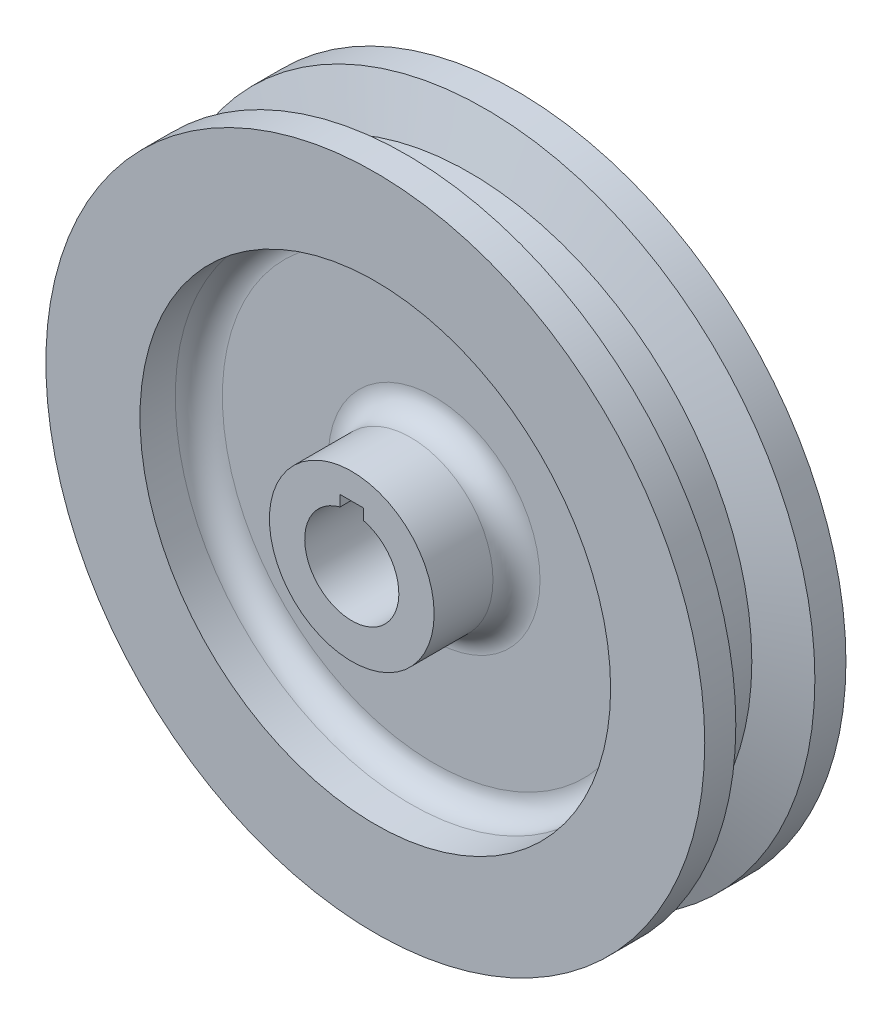
ISO-10303-21;
HEADER;
FILE_DESCRIPTION(('STEP AP214'),'2;1');
FILE_NAME('part.step','',(''),(''),'','','');
FILE_SCHEMA(('AUTOMOTIVE_DESIGN { 1 0 10303 214 1 1 1 1 }'));
ENDSEC;
DATA;
#1=APPLICATION_CONTEXT('core data for automotive mechanical design processes');
#2=APPLICATION_PROTOCOL_DEFINITION('international standard','automotive_design',2000,#1);
#3=PRODUCT_CONTEXT('',#1,'mechanical');
#4=PRODUCT('Part','Part','',(#3));
#5=PRODUCT_RELATED_PRODUCT_CATEGORY('part','',(#4));
#6=PRODUCT_DEFINITION_FORMATION('','',#4);
#7=PRODUCT_DEFINITION_CONTEXT('part definition',#1,'design');
#8=PRODUCT_DEFINITION('design','',#6,#7);
#9=PRODUCT_DEFINITION_SHAPE('','',#8);
#10=(LENGTH_UNIT() NAMED_UNIT(*) SI_UNIT(.MILLI.,.METRE.));
#11=(NAMED_UNIT(*) PLANE_ANGLE_UNIT() SI_UNIT($,.RADIAN.));
#12=(NAMED_UNIT(*) SI_UNIT($,.STERADIAN.) SOLID_ANGLE_UNIT());
#13=UNCERTAINTY_MEASURE_WITH_UNIT(LENGTH_MEASURE(1.E-05),#10,'distance_accuracy_value','');
#14=(GEOMETRIC_REPRESENTATION_CONTEXT(3) GLOBAL_UNCERTAINTY_ASSIGNED_CONTEXT((#13)) GLOBAL_UNIT_ASSIGNED_CONTEXT((#10,
#11,#12)) REPRESENTATION_CONTEXT('',''));
#15=CARTESIAN_POINT('',(0.,0.,0.));
#16=DIRECTION('',(0.,0.,1.));
#17=DIRECTION('',(1.,0.,0.));
#18=AXIS2_PLACEMENT_3D('',#15,#16,#17);
#19=CARTESIAN_POINT('',(0.,0.,1.47990681421083));
#20=DIRECTION('',(0.,0.,1.));
#21=DIRECTION('',(1.,0.,0.));
#22=AXIS2_PLACEMENT_3D('',#19,#20,#21);
#23=CYLINDRICAL_SURFACE('',#22,0.875);
#24=CARTESIAN_POINT('',(0.,0.,-0.375000000000002));
#25=DIRECTION('',(0.,0.,1.));
#26=DIRECTION('',(1.,0.,0.));
#27=AXIS2_PLACEMENT_3D('',#24,#25,#26);
#28=CIRCLE('',#27,0.875);
#29=CARTESIAN_POINT('',(0.875,0.,-0.375000000000002));
#30=VERTEX_POINT('',#29);
#31=EDGE_CURVE('E147',#30,#30,#28,.T.);
#32=ORIENTED_EDGE('',*,*,#31,.F.);
#33=EDGE_LOOP('',(#32));
#34=FACE_BOUND('',#33,.T.);
#35=CARTESIAN_POINT('',(0.,0.,-1.));
#36=DIRECTION('',(0.,0.,1.));
#37=DIRECTION('',(1.,0.,0.));
#38=AXIS2_PLACEMENT_3D('',#35,#36,#37);
#39=CIRCLE('',#38,0.875);
#40=CARTESIAN_POINT('',(0.875,0.,-1.));
#41=VERTEX_POINT('',#40);
#42=EDGE_CURVE('E91',#41,#41,#39,.T.);
#43=ORIENTED_EDGE('',*,*,#42,.T.);
#44=EDGE_LOOP('',(#43));
#45=FACE_BOUND('',#44,.T.);
#46=ADVANCED_FACE('F26',(#34,#45),#23,.T.);
#47=CARTESIAN_POINT('',(0.,0.,-0.375));
#48=DIRECTION('',(0.,0.,1.));
#49=DIRECTION('',(1.,0.,0.));
#50=AXIS2_PLACEMENT_3D('',#47,#48,#49);
#51=TOROIDAL_SURFACE('',#50,1.125,0.25);
#52=CARTESIAN_POINT('',(0.,0.,-0.125));
#53=DIRECTION('',(0.,0.,1.));
#54=DIRECTION('',(1.,0.,0.));
#55=AXIS2_PLACEMENT_3D('',#52,#53,#54);
#56=CIRCLE('',#55,1.125);
#57=CARTESIAN_POINT('',(1.125,0.,-0.125));
#58=VERTEX_POINT('',#57);
#59=EDGE_CURVE('E144',#58,#58,#56,.T.);
#60=ORIENTED_EDGE('',*,*,#59,.F.);
#61=EDGE_LOOP('',(#60));
#62=FACE_BOUND('',#61,.T.);
#63=ORIENTED_EDGE('',*,*,#31,.T.);
#64=EDGE_LOOP('',(#63));
#65=FACE_BOUND('',#64,.T.);
#66=ADVANCED_FACE('F168',(#62,#65),#51,.F.);
#67=CARTESIAN_POINT('',(0.,1.23429949811751,-0.125));
#68=DIRECTION('',(0.,0.,1.));
#69=DIRECTION('',(1.,0.,0.));
#70=AXIS2_PLACEMENT_3D('',#67,#68,#69);
#71=PLANE('',#70);
#72=CARTESIAN_POINT('',(0.,0.,-0.125));
#73=DIRECTION('',(0.,0.,1.));
#74=DIRECTION('',(1.,0.,0.));
#75=AXIS2_PLACEMENT_3D('',#72,#73,#74);
#76=CIRCLE('',#75,2.25);
#77=CARTESIAN_POINT('',(2.25,0.,-0.125));
#78=VERTEX_POINT('',#77);
#79=EDGE_CURVE('E141',#78,#78,#76,.T.);
#80=ORIENTED_EDGE('',*,*,#79,.F.);
#81=EDGE_LOOP('',(#80));
#82=FACE_BOUND('',#81,.T.);
#83=ORIENTED_EDGE('',*,*,#59,.T.);
#84=EDGE_LOOP('',(#83));
#85=FACE_BOUND('',#84,.T.);
#86=ADVANCED_FACE('F173',(#82,#85),#71,.F.);
#87=CARTESIAN_POINT('',(0.,0.,-0.375));
#88=DIRECTION('',(0.,0.,1.));
#89=DIRECTION('',(1.,0.,0.));
#90=AXIS2_PLACEMENT_3D('',#87,#88,#89);
#91=TOROIDAL_SURFACE('',#90,2.25,0.25);
#92=ORIENTED_EDGE('',*,*,#79,.T.);
#93=EDGE_LOOP('',(#92));
#94=FACE_BOUND('',#93,.T.);
#95=CARTESIAN_POINT('',(0.,0.,-0.375000000000002));
#96=DIRECTION('',(0.,0.,1.));
#97=DIRECTION('',(1.,0.,0.));
#98=AXIS2_PLACEMENT_3D('',#95,#96,#97);
#99=CIRCLE('',#98,2.5);
#100=CARTESIAN_POINT('',(2.5,0.,-0.375000000000002));
#101=VERTEX_POINT('',#100);
#102=EDGE_CURVE('E138',#101,#101,#99,.T.);
#103=ORIENTED_EDGE('',*,*,#102,.F.);
#104=EDGE_LOOP('',(#103));
#105=FACE_BOUND('',#104,.T.);
#106=ADVANCED_FACE('F182',(#94,#105),#91,.F.);
#107=CARTESIAN_POINT('',(0.,0.,1.47990681421083));
#108=DIRECTION('',(0.,0.,1.));
#109=DIRECTION('',(1.,0.,0.));
#110=AXIS2_PLACEMENT_3D('',#107,#108,#109);
#111=CYLINDRICAL_SURFACE('',#110,2.5);
#112=CARTESIAN_POINT('',(0.,0.,-0.75));
#113=DIRECTION('',(0.,0.,1.));
#114=DIRECTION('',(1.,0.,0.));
#115=AXIS2_PLACEMENT_3D('',#112,#113,#114);
#116=CIRCLE('',#115,2.5);
#117=CARTESIAN_POINT('',(2.5,0.,-0.75));
#118=VERTEX_POINT('',#117);
#119=EDGE_CURVE('E135',#118,#118,#116,.T.);
#120=ORIENTED_EDGE('',*,*,#119,.F.);
#121=EDGE_LOOP('',(#120));
#122=FACE_BOUND('',#121,.T.);
#123=ORIENTED_EDGE('',*,*,#102,.T.);
#124=EDGE_LOOP('',(#123));
#125=FACE_BOUND('',#124,.T.);
#126=ADVANCED_FACE('F189',(#122,#125),#111,.F.);
#127=CARTESIAN_POINT('',(0.,1.23429949811751,-0.75));
#128=DIRECTION('',(0.,0.,1.));
#129=DIRECTION('',(1.,0.,0.));
#130=AXIS2_PLACEMENT_3D('',#127,#128,#129);
#131=PLANE('',#130);
#132=CARTESIAN_POINT('',(0.,0.,-0.75));
#133=DIRECTION('',(0.,0.,1.));
#134=DIRECTION('',(1.,0.,0.));
#135=AXIS2_PLACEMENT_3D('',#132,#133,#134);
#136=CIRCLE('',#135,3.5);
#137=CARTESIAN_POINT('',(3.5,0.,-0.75));
#138=VERTEX_POINT('',#137);
#139=EDGE_CURVE('E132',#138,#138,#136,.T.);
#140=ORIENTED_EDGE('',*,*,#139,.F.);
#141=EDGE_LOOP('',(#140));
#142=FACE_BOUND('',#141,.T.);
#143=ORIENTED_EDGE('',*,*,#119,.T.);
#144=EDGE_LOOP('',(#143));
#145=FACE_BOUND('',#144,.T.);
#146=ADVANCED_FACE('F193',(#142,#145),#131,.F.);
#147=CARTESIAN_POINT('',(0.,0.,1.47990681421083));
#148=DIRECTION('',(0.,0.,1.));
#149=DIRECTION('',(1.,0.,0.));
#150=AXIS2_PLACEMENT_3D('',#147,#148,#149);
#151=CYLINDRICAL_SURFACE('',#150,3.5);
#152=ORIENTED_EDGE('',*,*,#139,.T.);
#153=EDGE_LOOP('',(#152));
#154=FACE_BOUND('',#153,.T.);
#155=CARTESIAN_POINT('',(0.,0.,-0.42));
#156=DIRECTION('',(0.,0.,1.));
#157=DIRECTION('',(1.,0.,0.));
#158=AXIS2_PLACEMENT_3D('',#155,#156,#157);
#159=CIRCLE('',#158,3.5);
#160=CARTESIAN_POINT('',(3.5,0.,-0.42));
#161=VERTEX_POINT('',#160);
#162=EDGE_CURVE('E129',#161,#161,#159,.T.);
#163=ORIENTED_EDGE('',*,*,#162,.F.);
#164=EDGE_LOOP('',(#163));
#165=FACE_BOUND('',#164,.T.);
#166=ADVANCED_FACE('F197',(#154,#165),#151,.T.);
#167=CARTESIAN_POINT('',(0.,0.,-0.25));
#168=DIRECTION('',(0.,0.,-1.));
#169=DIRECTION('',(-1.,0.,0.));
#170=AXIS2_PLACEMENT_3D('',#167,#168,#169);
#171=CONICAL_SURFACE('',#170,3.,1.24305782001434);
#172=ORIENTED_EDGE('',*,*,#162,.T.);
#173=EDGE_LOOP('',(#172));
#174=FACE_BOUND('',#173,.T.);
#175=CARTESIAN_POINT('',(0.,0.,-0.25));
#176=DIRECTION('',(0.,0.,1.));
#177=DIRECTION('',(1.,0.,0.));
#178=AXIS2_PLACEMENT_3D('',#175,#176,#177);
#179=CIRCLE('',#178,3.);
#180=CARTESIAN_POINT('',(3.,0.,-0.25));
#181=VERTEX_POINT('',#180);
#182=EDGE_CURVE('E126',#181,#181,#179,.T.);
#183=ORIENTED_EDGE('',*,*,#182,.F.);
#184=EDGE_LOOP('',(#183));
#185=FACE_BOUND('',#184,.T.);
#186=ADVANCED_FACE('F201',(#174,#185),#171,.T.);
#187=CARTESIAN_POINT('',(0.,0.,1.47990681421083));
#188=DIRECTION('',(0.,0.,1.));
#189=DIRECTION('',(1.,0.,0.));
#190=AXIS2_PLACEMENT_3D('',#187,#188,#189);
#191=CYLINDRICAL_SURFACE('',#190,3.);
#192=ORIENTED_EDGE('',*,*,#182,.T.);
#193=EDGE_LOOP('',(#192));
#194=FACE_BOUND('',#193,.T.);
#195=CARTESIAN_POINT('',(0.,0.,0.25));
#196=DIRECTION('',(0.,0.,1.));
#197=DIRECTION('',(1.,0.,0.));
#198=AXIS2_PLACEMENT_3D('',#195,#196,#197);
#199=CIRCLE('',#198,3.);
#200=CARTESIAN_POINT('',(3.,0.,0.25));
#201=VERTEX_POINT('',#200);
#202=EDGE_CURVE('E123',#201,#201,#199,.T.);
#203=ORIENTED_EDGE('',*,*,#202,.F.);
#204=EDGE_LOOP('',(#203));
#205=FACE_BOUND('',#204,.T.);
#206=ADVANCED_FACE('F205',(#194,#205),#191,.T.);
#207=CARTESIAN_POINT('',(0.,0.,0.42));
#208=DIRECTION('',(0.,0.,1.));
#209=DIRECTION('',(1.,0.,0.));
#210=AXIS2_PLACEMENT_3D('',#207,#208,#209);
#211=CONICAL_SURFACE('',#210,3.5,1.24305782001434);
#212=ORIENTED_EDGE('',*,*,#202,.T.);
#213=EDGE_LOOP('',(#212));
#214=FACE_BOUND('',#213,.T.);
#215=CARTESIAN_POINT('',(0.,0.,0.42));
#216=DIRECTION('',(0.,0.,1.));
#217=DIRECTION('',(1.,0.,0.));
#218=AXIS2_PLACEMENT_3D('',#215,#216,#217);
#219=CIRCLE('',#218,3.5);
#220=CARTESIAN_POINT('',(3.5,0.,0.42));
#221=VERTEX_POINT('',#220);
#222=EDGE_CURVE('E120',#221,#221,#219,.T.);
#223=ORIENTED_EDGE('',*,*,#222,.F.);
#224=EDGE_LOOP('',(#223));
#225=FACE_BOUND('',#224,.T.);
#226=ADVANCED_FACE('F209',(#214,#225),#211,.T.);
#227=CARTESIAN_POINT('',(0.,0.,1.47990681421083));
#228=DIRECTION('',(0.,0.,1.));
#229=DIRECTION('',(1.,0.,0.));
#230=AXIS2_PLACEMENT_3D('',#227,#228,#229);
#231=CYLINDRICAL_SURFACE('',#230,3.5);
#232=ORIENTED_EDGE('',*,*,#222,.T.);
#233=EDGE_LOOP('',(#232));
#234=FACE_BOUND('',#233,.T.);
#235=CARTESIAN_POINT('',(0.,0.,0.75));
#236=DIRECTION('',(0.,0.,1.));
#237=DIRECTION('',(1.,0.,0.));
#238=AXIS2_PLACEMENT_3D('',#235,#236,#237);
#239=CIRCLE('',#238,3.5);
#240=CARTESIAN_POINT('',(3.5,0.,0.75));
#241=VERTEX_POINT('',#240);
#242=EDGE_CURVE('E117',#241,#241,#239,.T.);
#243=ORIENTED_EDGE('',*,*,#242,.F.);
#244=EDGE_LOOP('',(#243));
#245=FACE_BOUND('',#244,.T.);
#246=ADVANCED_FACE('F213',(#234,#245),#231,.T.);
#247=CARTESIAN_POINT('',(0.,1.23429949811751,0.75));
#248=DIRECTION('',(0.,0.,-1.));
#249=DIRECTION('',(-1.,0.,0.));
#250=AXIS2_PLACEMENT_3D('',#247,#248,#249);
#251=PLANE('',#250);
#252=CARTESIAN_POINT('',(0.,0.,0.75));
#253=DIRECTION('',(0.,0.,1.));
#254=DIRECTION('',(1.,0.,0.));
#255=AXIS2_PLACEMENT_3D('',#252,#253,#254);
#256=CIRCLE('',#255,2.5);
#257=CARTESIAN_POINT('',(2.5,0.,0.75));
#258=VERTEX_POINT('',#257);
#259=EDGE_CURVE('E114',#258,#258,#256,.T.);
#260=ORIENTED_EDGE('',*,*,#259,.F.);
#261=EDGE_LOOP('',(#260));
#262=FACE_BOUND('',#261,.T.);
#263=ORIENTED_EDGE('',*,*,#242,.T.);
#264=EDGE_LOOP('',(#263));
#265=FACE_BOUND('',#264,.T.);
#266=ADVANCED_FACE('F217',(#262,#265),#251,.F.);
#267=CARTESIAN_POINT('',(0.,0.,1.47990681421083));
#268=DIRECTION('',(0.,0.,1.));
#269=DIRECTION('',(1.,0.,0.));
#270=AXIS2_PLACEMENT_3D('',#267,#268,#269);
#271=CYLINDRICAL_SURFACE('',#270,2.5);
#272=ORIENTED_EDGE('',*,*,#259,.T.);
#273=EDGE_LOOP('',(#272));
#274=FACE_BOUND('',#273,.T.);
#275=CARTESIAN_POINT('',(0.,0.,0.375000000000002));
#276=DIRECTION('',(0.,0.,1.));
#277=DIRECTION('',(1.,0.,0.));
#278=AXIS2_PLACEMENT_3D('',#275,#276,#277);
#279=CIRCLE('',#278,2.5);
#280=CARTESIAN_POINT('',(2.5,0.,0.375000000000002));
#281=VERTEX_POINT('',#280);
#282=EDGE_CURVE('E111',#281,#281,#279,.T.);
#283=ORIENTED_EDGE('',*,*,#282,.F.);
#284=EDGE_LOOP('',(#283));
#285=FACE_BOUND('',#284,.T.);
#286=ADVANCED_FACE('F221',(#274,#285),#271,.F.);
#287=CARTESIAN_POINT('',(0.,0.,0.375));
#288=DIRECTION('',(0.,0.,1.));
#289=DIRECTION('',(1.,0.,0.));
#290=AXIS2_PLACEMENT_3D('',#287,#288,#289);
#291=TOROIDAL_SURFACE('',#290,2.25,0.25);
#292=CARTESIAN_POINT('',(0.,0.,0.125));
#293=DIRECTION('',(0.,0.,1.));
#294=DIRECTION('',(1.,0.,0.));
#295=AXIS2_PLACEMENT_3D('',#292,#293,#294);
#296=CIRCLE('',#295,2.25);
#297=CARTESIAN_POINT('',(2.25,0.,0.125));
#298=VERTEX_POINT('',#297);
#299=EDGE_CURVE('E108',#298,#298,#296,.T.);
#300=ORIENTED_EDGE('',*,*,#299,.F.);
#301=EDGE_LOOP('',(#300));
#302=FACE_BOUND('',#301,.T.);
#303=ORIENTED_EDGE('',*,*,#282,.T.);
#304=EDGE_LOOP('',(#303));
#305=FACE_BOUND('',#304,.T.);
#306=ADVANCED_FACE('F225',(#302,#305),#291,.F.);
#307=CARTESIAN_POINT('',(0.,1.23429949811751,0.125));
#308=DIRECTION('',(0.,0.,1.));
#309=DIRECTION('',(1.,0.,0.));
#310=AXIS2_PLACEMENT_3D('',#307,#308,#309);
#311=PLANE('',#310);
#312=ORIENTED_EDGE('',*,*,#299,.T.);
#313=EDGE_LOOP('',(#312));
#314=FACE_BOUND('',#313,.T.);
#315=CARTESIAN_POINT('',(0.,0.,0.125));
#316=DIRECTION('',(0.,0.,1.));
#317=DIRECTION('',(1.,0.,0.));
#318=AXIS2_PLACEMENT_3D('',#315,#316,#317);
#319=CIRCLE('',#318,1.125);
#320=CARTESIAN_POINT('',(1.125,0.,0.125));
#321=VERTEX_POINT('',#320);
#322=EDGE_CURVE('E105',#321,#321,#319,.T.);
#323=ORIENTED_EDGE('',*,*,#322,.F.);
#324=EDGE_LOOP('',(#323));
#325=FACE_BOUND('',#324,.T.);
#326=ADVANCED_FACE('F229',(#314,#325),#311,.T.);
#327=CARTESIAN_POINT('',(0.,0.,0.375));
#328=DIRECTION('',(0.,0.,1.));
#329=DIRECTION('',(1.,0.,0.));
#330=AXIS2_PLACEMENT_3D('',#327,#328,#329);
#331=TOROIDAL_SURFACE('',#330,1.125,0.25);
#332=CARTESIAN_POINT('',(0.,0.,0.375000000000002));
#333=DIRECTION('',(0.,0.,1.));
#334=DIRECTION('',(1.,0.,0.));
#335=AXIS2_PLACEMENT_3D('',#332,#333,#334);
#336=CIRCLE('',#335,0.875);
#337=CARTESIAN_POINT('',(0.875,0.,0.375000000000002));
#338=VERTEX_POINT('',#337);
#339=EDGE_CURVE('E102',#338,#338,#336,.T.);
#340=ORIENTED_EDGE('',*,*,#339,.F.);
#341=EDGE_LOOP('',(#340));
#342=FACE_BOUND('',#341,.T.);
#343=ORIENTED_EDGE('',*,*,#322,.T.);
#344=EDGE_LOOP('',(#343));
#345=FACE_BOUND('',#344,.T.);
#346=ADVANCED_FACE('F233',(#342,#345),#331,.F.);
#347=CARTESIAN_POINT('',(0.,0.,1.47990681421083));
#348=DIRECTION('',(0.,0.,1.));
#349=DIRECTION('',(1.,0.,0.));
#350=AXIS2_PLACEMENT_3D('',#347,#348,#349);
#351=CYLINDRICAL_SURFACE('',#350,0.875);
#352=ORIENTED_EDGE('',*,*,#339,.T.);
#353=EDGE_LOOP('',(#352));
#354=FACE_BOUND('',#353,.T.);
#355=CARTESIAN_POINT('',(0.,0.,1.));
#356=DIRECTION('',(0.,0.,1.));
#357=DIRECTION('',(1.,0.,0.));
#358=AXIS2_PLACEMENT_3D('',#355,#356,#357);
#359=CIRCLE('',#358,0.875);
#360=CARTESIAN_POINT('',(0.875,0.,1.));
#361=VERTEX_POINT('',#360);
#362=EDGE_CURVE('E99',#361,#361,#359,.T.);
#363=ORIENTED_EDGE('',*,*,#362,.F.);
#364=EDGE_LOOP('',(#363));
#365=FACE_BOUND('',#364,.T.);
#366=ADVANCED_FACE('F165',(#354,#365),#351,.T.);
#367=CARTESIAN_POINT('',(0.,1.23429949811751,1.));
#368=DIRECTION('',(0.,0.,1.));
#369=DIRECTION('',(1.,0.,0.));
#370=AXIS2_PLACEMENT_3D('',#367,#368,#369);
#371=PLANE('',#370);
#372=DIRECTION('',(0.,-1.,0.));
#373=VECTOR('',#372,1.);
#374=CARTESIAN_POINT('',(-0.125,0.229211156409766,1.));
#375=LINE('',#374,#373);
#376=CARTESIAN_POINT('',(-0.125,0.6,1.));
#377=VERTEX_POINT('',#376);
#378=CARTESIAN_POINT('',(-0.125,0.484122918275927,1.));
#379=VERTEX_POINT('',#378);
#380=EDGE_CURVE('E81',#377,#379,#375,.T.);
#381=ORIENTED_EDGE('',*,*,#380,.F.);
#382=DIRECTION('',(-1.,0.,0.));
#383=VECTOR('',#382,1.);
#384=CARTESIAN_POINT('',(-0.125,0.6,1.));
#385=LINE('',#384,#383);
#386=CARTESIAN_POINT('',(0.125,0.6,1.));
#387=VERTEX_POINT('',#386);
#388=EDGE_CURVE('E67',#387,#377,#385,.T.);
#389=ORIENTED_EDGE('',*,*,#388,.F.);
#390=DIRECTION('',(0.,1.,0.));
#391=VECTOR('',#390,1.);
#392=CARTESIAN_POINT('',(0.125,0.6,1.));
#393=LINE('',#392,#391);
#394=CARTESIAN_POINT('',(0.125,0.484122918275927,1.));
#395=VERTEX_POINT('',#394);
#396=EDGE_CURVE('E74',#395,#387,#393,.T.);
#397=ORIENTED_EDGE('',*,*,#396,.F.);
#398=CARTESIAN_POINT('',(0.,0.,1.));
#399=DIRECTION('',(0.,0.,1.));
#400=DIRECTION('',(1.,0.,0.));
#401=AXIS2_PLACEMENT_3D('',#398,#399,#400);
#402=CIRCLE('',#401,0.5);
#403=EDGE_CURVE('E97',#379,#395,#402,.T.);
#404=ORIENTED_EDGE('',*,*,#403,.F.);
#405=EDGE_LOOP('',(#381,#389,#397,#404));
#406=FACE_BOUND('',#405,.T.);
#407=ORIENTED_EDGE('',*,*,#362,.T.);
#408=EDGE_LOOP('',(#407));
#409=FACE_BOUND('',#408,.T.);
#410=ADVANCED_FACE('F83',(#406,#409),#371,.T.);
#411=CARTESIAN_POINT('',(0.,0.,1.47990681421083));
#412=DIRECTION('',(0.,0.,1.));
#413=DIRECTION('',(1.,0.,0.));
#414=AXIS2_PLACEMENT_3D('',#411,#412,#413);
#415=CYLINDRICAL_SURFACE('',#414,0.5);
#416=CARTESIAN_POINT('',(0.,0.,-1.));
#417=DIRECTION('',(0.,0.,1.));
#418=DIRECTION('',(1.,0.,0.));
#419=AXIS2_PLACEMENT_3D('',#416,#417,#418);
#420=CIRCLE('',#419,0.5);
#421=CARTESIAN_POINT('',(-0.125,0.484122918275927,-1.));
#422=VERTEX_POINT('',#421);
#423=CARTESIAN_POINT('',(0.125,0.484122918275927,-1.));
#424=VERTEX_POINT('',#423);
#425=EDGE_CURVE('E94',#422,#424,#420,.T.);
#426=ORIENTED_EDGE('',*,*,#425,.F.);
#427=DIRECTION('',(0.,0.,1.));
#428=VECTOR('',#427,1.);
#429=CARTESIAN_POINT('',(-0.125,0.484122918275927,1.47990681421083));
#430=LINE('',#429,#428);
#431=EDGE_CURVE('E48',#422,#379,#430,.T.);
#432=ORIENTED_EDGE('',*,*,#431,.T.);
#433=ORIENTED_EDGE('',*,*,#403,.T.);
#434=DIRECTION('',(0.,0.,1.));
#435=VECTOR('',#434,1.);
#436=CARTESIAN_POINT('',(0.125,0.484122918275927,1.47990681421083));
#437=LINE('',#436,#435);
#438=EDGE_CURVE('E77',#395,#424,#437,.F.);
#439=ORIENTED_EDGE('',*,*,#438,.T.);
#440=EDGE_LOOP('',(#426,#432,#433,#439));
#441=FACE_BOUND('',#440,.T.);
#442=ADVANCED_FACE('F155',(#441),#415,.F.);
#443=CARTESIAN_POINT('',(0.,1.23429949811751,-1.));
#444=DIRECTION('',(0.,0.,1.));
#445=DIRECTION('',(1.,0.,0.));
#446=AXIS2_PLACEMENT_3D('',#443,#444,#445);
#447=PLANE('',#446);
#448=ORIENTED_EDGE('',*,*,#42,.F.);
#449=EDGE_LOOP('',(#448));
#450=FACE_BOUND('',#449,.T.);
#451=DIRECTION('',(-1.,0.,0.));
#452=VECTOR('',#451,1.);
#453=CARTESIAN_POINT('',(0.,0.6,-1.));
#454=LINE('',#453,#452);
#455=CARTESIAN_POINT('',(0.125,0.6,-1.));
#456=VERTEX_POINT('',#455);
#457=CARTESIAN_POINT('',(-0.125,0.6,-1.));
#458=VERTEX_POINT('',#457);
#459=EDGE_CURVE('E33',#456,#458,#454,.T.);
#460=ORIENTED_EDGE('',*,*,#459,.T.);
#461=DIRECTION('',(0.,-1.,0.));
#462=VECTOR('',#461,1.);
#463=CARTESIAN_POINT('',(-0.125,1.23429949811751,-1.));
#464=LINE('',#463,#462);
#465=EDGE_CURVE('E11',#458,#422,#464,.T.);
#466=ORIENTED_EDGE('',*,*,#465,.T.);
#467=ORIENTED_EDGE('',*,*,#425,.T.);
#468=DIRECTION('',(0.,1.,0.));
#469=VECTOR('',#468,1.);
#470=CARTESIAN_POINT('',(0.125,1.23429949811751,-1.));
#471=LINE('',#470,#469);
#472=EDGE_CURVE('E150',#424,#456,#471,.T.);
#473=ORIENTED_EDGE('',*,*,#472,.T.);
#474=EDGE_LOOP('',(#460,#466,#467,#473));
#475=FACE_BOUND('',#474,.T.);
#476=ADVANCED_FACE('F152',(#450,#475),#447,.F.);
#477=CARTESIAN_POINT('',(-0.125,0.229211156409766,-19.6248));
#478=DIRECTION('',(-1.,0.,0.));
#479=DIRECTION('',(0.,0.,1.));
#480=AXIS2_PLACEMENT_3D('',#477,#478,#479);
#481=PLANE('',#480);
#482=ORIENTED_EDGE('',*,*,#465,.F.);
#483=DIRECTION('',(0.,0.,1.));
#484=VECTOR('',#483,1.);
#485=CARTESIAN_POINT('',(-0.125,0.6,-19.6248));
#486=LINE('',#485,#484);
#487=EDGE_CURVE('E71',#458,#377,#486,.T.);
#488=ORIENTED_EDGE('',*,*,#487,.T.);
#489=ORIENTED_EDGE('',*,*,#380,.T.);
#490=ORIENTED_EDGE('',*,*,#431,.F.);
#491=EDGE_LOOP('',(#482,#488,#489,#490));
#492=FACE_BOUND('',#491,.T.);
#493=ADVANCED_FACE('F162',(#492),#481,.F.);
#494=CARTESIAN_POINT('',(-0.125,0.6,-19.6248));
#495=DIRECTION('',(0.,1.,0.));
#496=DIRECTION('',(0.,0.,1.));
#497=AXIS2_PLACEMENT_3D('',#494,#495,#496);
#498=PLANE('',#497);
#499=DIRECTION('',(0.,0.,1.));
#500=VECTOR('',#499,1.);
#501=CARTESIAN_POINT('',(0.125,0.6,-19.6248));
#502=LINE('',#501,#500);
#503=EDGE_CURVE('E40',#456,#387,#502,.T.);
#504=ORIENTED_EDGE('',*,*,#503,.T.);
#505=ORIENTED_EDGE('',*,*,#388,.T.);
#506=ORIENTED_EDGE('',*,*,#487,.F.);
#507=ORIENTED_EDGE('',*,*,#459,.F.);
#508=EDGE_LOOP('',(#504,#505,#506,#507));
#509=FACE_BOUND('',#508,.T.);
#510=ADVANCED_FACE('F64',(#509),#498,.F.);
#511=CARTESIAN_POINT('',(0.125,0.6,-19.6248));
#512=DIRECTION('',(1.,0.,0.));
#513=DIRECTION('',(0.,0.,-1.));
#514=AXIS2_PLACEMENT_3D('',#511,#512,#513);
#515=PLANE('',#514);
#516=ORIENTED_EDGE('',*,*,#396,.T.);
#517=ORIENTED_EDGE('',*,*,#503,.F.);
#518=ORIENTED_EDGE('',*,*,#472,.F.);
#519=ORIENTED_EDGE('',*,*,#438,.F.);
#520=EDGE_LOOP('',(#516,#517,#518,#519));
#521=FACE_BOUND('',#520,.T.);
#522=ADVANCED_FACE('F75',(#521),#515,.F.);
#523=CLOSED_SHELL('',(#46,#66,#86,#106,#126,#146,#166,#186,#206,#226,#246,#266,#286,#306,#326,
#346,#366,#410,#442,#476,#493,#510,#522));
#524=MANIFOLD_SOLID_BREP('B2',#523);
#525=ADVANCED_BREP_SHAPE_REPRESENTATION('',(#18,#524),#14);
#526=SHAPE_DEFINITION_REPRESENTATION(#9,#525);
ENDSEC;
END-ISO-10303-21;
